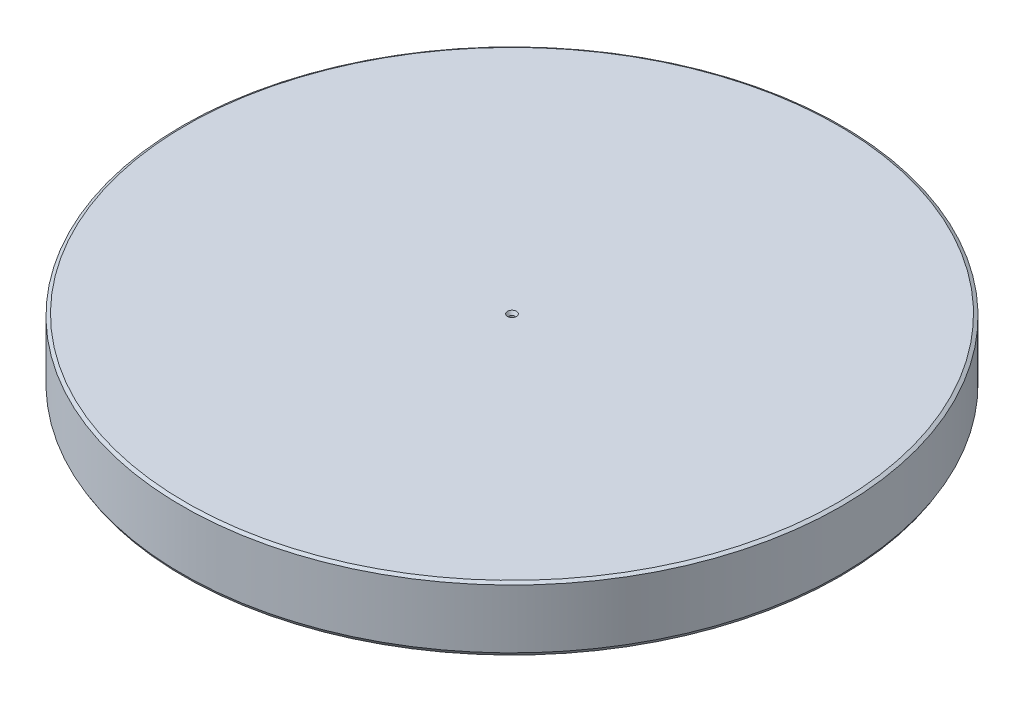
ISO-10303-21;
HEADER;
FILE_DESCRIPTION(('STEP AP214'),'2;1');
FILE_NAME('part.step','',(''),(''),'','','');
FILE_SCHEMA(('AUTOMOTIVE_DESIGN { 1 0 10303 214 1 1 1 1 }'));
ENDSEC;
DATA;
#1=APPLICATION_CONTEXT('core data for automotive mechanical design processes');
#2=APPLICATION_PROTOCOL_DEFINITION('international standard','automotive_design',2000,#1);
#3=PRODUCT_CONTEXT('',#1,'mechanical');
#4=PRODUCT('Part','Part','',(#3));
#5=PRODUCT_RELATED_PRODUCT_CATEGORY('part','',(#4));
#6=PRODUCT_DEFINITION_FORMATION('','',#4);
#7=PRODUCT_DEFINITION_CONTEXT('part definition',#1,'design');
#8=PRODUCT_DEFINITION('design','',#6,#7);
#9=PRODUCT_DEFINITION_SHAPE('','',#8);
#10=(LENGTH_UNIT() NAMED_UNIT(*) SI_UNIT(.MILLI.,.METRE.));
#11=(NAMED_UNIT(*) PLANE_ANGLE_UNIT() SI_UNIT($,.RADIAN.));
#12=(NAMED_UNIT(*) SI_UNIT($,.STERADIAN.) SOLID_ANGLE_UNIT());
#13=UNCERTAINTY_MEASURE_WITH_UNIT(LENGTH_MEASURE(1.E-05),#10,'distance_accuracy_value','');
#14=(GEOMETRIC_REPRESENTATION_CONTEXT(3) GLOBAL_UNCERTAINTY_ASSIGNED_CONTEXT((#13)) GLOBAL_UNIT_ASSIGNED_CONTEXT((#10,
#11,#12)) REPRESENTATION_CONTEXT('',''));
#15=CARTESIAN_POINT('',(0.,0.,0.));
#16=DIRECTION('',(0.,0.,1.));
#17=DIRECTION('',(1.,0.,0.));
#18=AXIS2_PLACEMENT_3D('',#15,#16,#17);
#19=CARTESIAN_POINT('',(0.,-136.8,0.));
#20=DIRECTION('',(0.,1.,0.));
#21=DIRECTION('',(-1.,0.,0.));
#22=AXIS2_PLACEMENT_3D('',#19,#20,#21);
#23=CONICAL_SURFACE('',#22,0.25,0.52359877620608);
#24=CARTESIAN_POINT('',(0.,-136.5,0.));
#25=DIRECTION('',(0.,1.,0.));
#26=DIRECTION('',(-1.,0.,0.));
#27=AXIS2_PLACEMENT_3D('',#24,#25,#26);
#28=CIRCLE('',#27,0.423205081);
#29=CARTESIAN_POINT('',(0.423205081,-136.5,0.));
#30=VERTEX_POINT('',#29);
#31=EDGE_CURVE('E11',#30,#30,#28,.T.);
#32=ORIENTED_EDGE('',*,*,#31,.T.);
#33=EDGE_LOOP('',(#32));
#34=FACE_BOUND('',#33,.T.);
#35=CARTESIAN_POINT('',(0.,-136.8,0.));
#36=DIRECTION('',(1.32272665043231E-13,-1.,0.));
#37=DIRECTION('',(-1.,-1.32272665043231E-13,0.));
#38=AXIS2_PLACEMENT_3D('',#35,#36,#37);
#39=CIRCLE('',#38,0.25);
#40=CARTESIAN_POINT('',(-0.25,-136.8,0.));
#41=VERTEX_POINT('',#40);
#42=EDGE_CURVE('E20',#41,#41,#39,.T.);
#43=ORIENTED_EDGE('',*,*,#42,.T.);
#44=EDGE_LOOP('',(#43));
#45=FACE_BOUND('',#44,.T.);
#46=ADVANCED_FACE('F17',(#34,#45),#23,.F.);
#47=CARTESIAN_POINT('',(-31.0684,-136.5,-31.0684));
#48=DIRECTION('',(0.,-1.,0.));
#49=DIRECTION('',(1.,0.,0.));
#50=AXIS2_PLACEMENT_3D('',#47,#48,#49);
#51=PLANE('',#50);
#52=ORIENTED_EDGE('',*,*,#31,.F.);
#53=EDGE_LOOP('',(#52));
#54=FACE_BOUND('',#53,.T.);
#55=CARTESIAN_POINT('',(0.,-136.5,0.));
#56=DIRECTION('',(0.,1.,0.));
#57=DIRECTION('',(1.,0.,0.));
#58=AXIS2_PLACEMENT_3D('',#55,#56,#57);
#59=CIRCLE('',#58,30.7);
#60=CARTESIAN_POINT('',(30.7,-136.5,0.));
#61=VERTEX_POINT('',#60);
#62=EDGE_CURVE('E89',#61,#61,#59,.T.);
#63=ORIENTED_EDGE('',*,*,#62,.T.);
#64=EDGE_LOOP('',(#63));
#65=FACE_BOUND('',#64,.T.);
#66=ADVANCED_FACE('F171',(#54,#65),#51,.F.);
#67=CARTESIAN_POINT('',(0.,-142.326794919,0.));
#68=DIRECTION('',(0.,1.,0.));
#69=DIRECTION('',(-1.,0.,0.));
#70=AXIS2_PLACEMENT_3D('',#67,#68,#69);
#71=CYLINDRICAL_SURFACE('',#70,0.25);
#72=ORIENTED_EDGE('',*,*,#42,.F.);
#73=EDGE_LOOP('',(#72));
#74=FACE_BOUND('',#73,.T.);
#75=CARTESIAN_POINT('',(0.,-142.326794919,0.));
#76=DIRECTION('',(0.,-1.,0.));
#77=DIRECTION('',(-1.,0.,0.));
#78=AXIS2_PLACEMENT_3D('',#75,#76,#77);
#79=CIRCLE('',#78,0.25);
#80=CARTESIAN_POINT('',(0.25,-142.326794919,0.));
#81=VERTEX_POINT('',#80);
#82=EDGE_CURVE('E85',#81,#81,#79,.T.);
#83=ORIENTED_EDGE('',*,*,#82,.T.);
#84=EDGE_LOOP('',(#83));
#85=FACE_BOUND('',#84,.T.);
#86=ADVANCED_FACE('F86',(#74,#85),#71,.F.);
#87=CARTESIAN_POINT('',(0.,-136.5,0.));
#88=DIRECTION('',(0.,-1.,0.));
#89=DIRECTION('',(1.,0.,0.));
#90=AXIS2_PLACEMENT_3D('',#87,#88,#89);
#91=CONICAL_SURFACE('',#90,30.7,1.04719755058881);
#92=ORIENTED_EDGE('',*,*,#62,.F.);
#93=EDGE_LOOP('',(#92));
#94=FACE_BOUND('',#93,.T.);
#95=CARTESIAN_POINT('',(0.,-136.673205081,0.));
#96=DIRECTION('',(0.,1.,0.));
#97=DIRECTION('',(-1.,0.,0.));
#98=AXIS2_PLACEMENT_3D('',#95,#96,#97);
#99=CIRCLE('',#98,31.);
#100=CARTESIAN_POINT('',(-31.,-136.673205081,0.));
#101=VERTEX_POINT('',#100);
#102=EDGE_CURVE('E79',#101,#101,#99,.T.);
#103=ORIENTED_EDGE('',*,*,#102,.T.);
#104=EDGE_LOOP('',(#103));
#105=FACE_BOUND('',#104,.T.);
#106=ADVANCED_FACE('F142',(#94,#105),#91,.T.);
#107=CARTESIAN_POINT('',(0.,-142.326794919,0.));
#108=DIRECTION('',(0.,-1.,0.));
#109=DIRECTION('',(1.,0.,0.));
#110=AXIS2_PLACEMENT_3D('',#107,#108,#109);
#111=CONICAL_SURFACE('',#110,0.25,1.04719755058881);
#112=CARTESIAN_POINT('',(0.,-142.5,0.));
#113=DIRECTION('',(0.,1.,0.));
#114=DIRECTION('',(1.,0.,0.));
#115=AXIS2_PLACEMENT_3D('',#112,#113,#114);
#116=CIRCLE('',#115,0.549999999999817);
#117=CARTESIAN_POINT('',(-0.549999999999817,-142.5,0.));
#118=VERTEX_POINT('',#117);
#119=EDGE_CURVE('E97',#118,#118,#116,.T.);
#120=ORIENTED_EDGE('',*,*,#119,.F.);
#121=EDGE_LOOP('',(#120));
#122=FACE_BOUND('',#121,.T.);
#123=ORIENTED_EDGE('',*,*,#82,.F.);
#124=EDGE_LOOP('',(#123));
#125=FACE_BOUND('',#124,.T.);
#126=ADVANCED_FACE('F146',(#122,#125),#111,.F.);
#127=CARTESIAN_POINT('',(0.,-142.2,0.));
#128=DIRECTION('',(0.,1.,0.));
#129=DIRECTION('',(-1.,0.,0.));
#130=AXIS2_PLACEMENT_3D('',#127,#128,#129);
#131=CYLINDRICAL_SURFACE('',#130,31.);
#132=CARTESIAN_POINT('',(0.,-142.2,0.));
#133=DIRECTION('',(0.,1.,0.));
#134=DIRECTION('',(-1.,0.,0.));
#135=AXIS2_PLACEMENT_3D('',#132,#133,#134);
#136=CIRCLE('',#135,31.);
#137=CARTESIAN_POINT('',(-31.,-142.2,0.));
#138=VERTEX_POINT('',#137);
#139=EDGE_CURVE('E72',#138,#138,#136,.T.);
#140=ORIENTED_EDGE('',*,*,#139,.T.);
#141=EDGE_LOOP('',(#140));
#142=FACE_BOUND('',#141,.T.);
#143=ORIENTED_EDGE('',*,*,#102,.F.);
#144=EDGE_LOOP('',(#143));
#145=FACE_BOUND('',#144,.T.);
#146=ADVANCED_FACE('F155',(#142,#145),#131,.T.);
#147=CARTESIAN_POINT('',(-31.196716458,-142.5,-31.196716458));
#148=DIRECTION('',(0.,-1.,0.));
#149=DIRECTION('',(1.,0.,0.));
#150=AXIS2_PLACEMENT_3D('',#147,#148,#149);
#151=PLANE('',#150);
#152=ORIENTED_EDGE('',*,*,#119,.T.);
#153=EDGE_LOOP('',(#152));
#154=FACE_BOUND('',#153,.T.);
#155=CARTESIAN_POINT('',(0.,-142.5,0.));
#156=DIRECTION('',(0.,-1.,0.));
#157=DIRECTION('',(-1.,0.,0.));
#158=AXIS2_PLACEMENT_3D('',#155,#156,#157);
#159=CIRCLE('',#158,30.826794919);
#160=CARTESIAN_POINT('',(-30.826794919,-142.5,0.));
#161=VERTEX_POINT('',#160);
#162=EDGE_CURVE('E59',#161,#161,#159,.T.);
#163=ORIENTED_EDGE('',*,*,#162,.T.);
#164=EDGE_LOOP('',(#163));
#165=FACE_BOUND('',#164,.T.);
#166=ADVANCED_FACE('F136',(#154,#165),#151,.T.);
#167=CARTESIAN_POINT('',(0.,-142.5,0.));
#168=DIRECTION('',(0.,1.,0.));
#169=DIRECTION('',(-1.,0.,0.));
#170=AXIS2_PLACEMENT_3D('',#167,#168,#169);
#171=CONICAL_SURFACE('',#170,30.826794919,0.523598776206073);
#172=ORIENTED_EDGE('',*,*,#162,.F.);
#173=EDGE_LOOP('',(#172));
#174=FACE_BOUND('',#173,.T.);
#175=ORIENTED_EDGE('',*,*,#139,.F.);
#176=EDGE_LOOP('',(#175));
#177=FACE_BOUND('',#176,.T.);
#178=ADVANCED_FACE('F132',(#174,#177),#171,.T.);
#179=CLOSED_SHELL('',(#46,#66,#86,#106,#126,#146,#166,#178));
#180=MANIFOLD_SOLID_BREP('B1',#179);
#181=ADVANCED_BREP_SHAPE_REPRESENTATION('',(#18,#180),#14);
#182=SHAPE_DEFINITION_REPRESENTATION(#9,#181);
ENDSEC;
END-ISO-10303-21;
